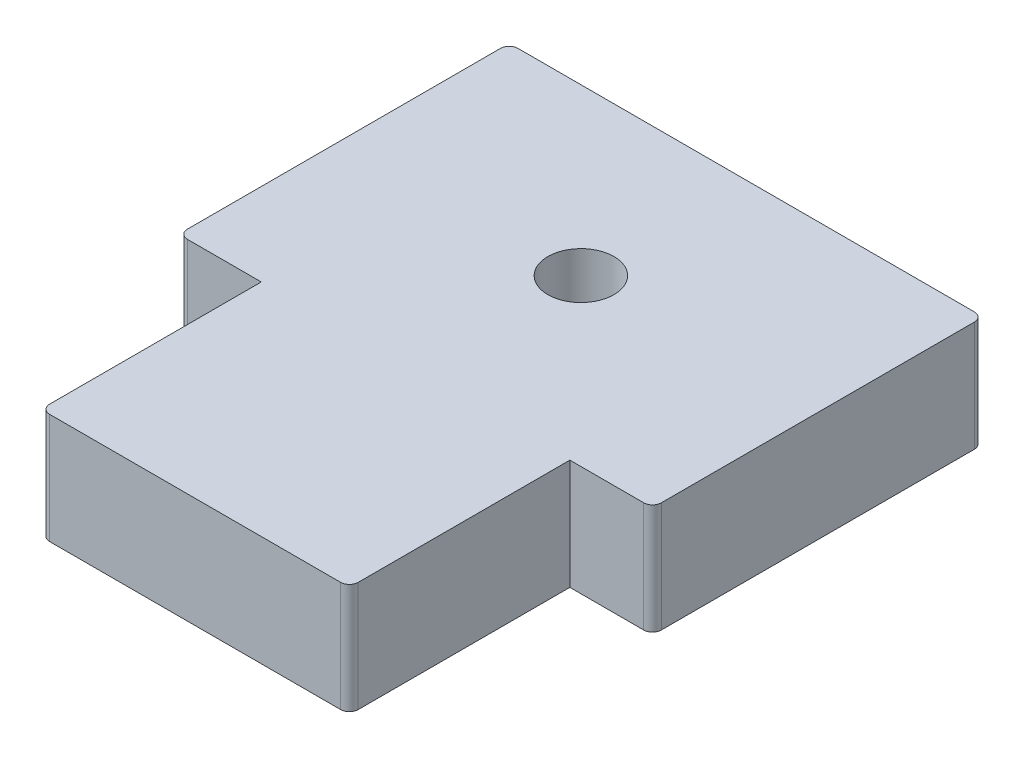
ISO-10303-21;
HEADER;
FILE_DESCRIPTION(('STEP AP214'),'2;1');
FILE_NAME('part.step','',(''),(''),'','','');
FILE_SCHEMA(('AUTOMOTIVE_DESIGN { 1 0 10303 214 1 1 1 1 }'));
ENDSEC;
DATA;
#1=APPLICATION_CONTEXT('core data for automotive mechanical design processes');
#2=APPLICATION_PROTOCOL_DEFINITION('international standard','automotive_design',2000,#1);
#3=PRODUCT_CONTEXT('',#1,'mechanical');
#4=PRODUCT('Part','Part','',(#3));
#5=PRODUCT_RELATED_PRODUCT_CATEGORY('part','',(#4));
#6=PRODUCT_DEFINITION_FORMATION('','',#4);
#7=PRODUCT_DEFINITION_CONTEXT('part definition',#1,'design');
#8=PRODUCT_DEFINITION('design','',#6,#7);
#9=PRODUCT_DEFINITION_SHAPE('','',#8);
#10=(LENGTH_UNIT() NAMED_UNIT(*) SI_UNIT(.MILLI.,.METRE.));
#11=(NAMED_UNIT(*) PLANE_ANGLE_UNIT() SI_UNIT($,.RADIAN.));
#12=(NAMED_UNIT(*) SI_UNIT($,.STERADIAN.) SOLID_ANGLE_UNIT());
#13=UNCERTAINTY_MEASURE_WITH_UNIT(LENGTH_MEASURE(1.E-05),#10,'distance_accuracy_value','');
#14=(GEOMETRIC_REPRESENTATION_CONTEXT(3) GLOBAL_UNCERTAINTY_ASSIGNED_CONTEXT((#13)) GLOBAL_UNIT_ASSIGNED_CONTEXT((#10,
#11,#12)) REPRESENTATION_CONTEXT('',''));
#15=CARTESIAN_POINT('',(0.,0.,0.));
#16=DIRECTION('',(0.,0.,1.));
#17=DIRECTION('',(1.,0.,0.));
#18=AXIS2_PLACEMENT_3D('',#15,#16,#17);
#19=CARTESIAN_POINT('',(140.,100.,150.));
#20=DIRECTION('',(0.,0.,-1.));
#21=DIRECTION('',(-1.,0.,0.));
#22=AXIS2_PLACEMENT_3D('',#19,#20,#21);
#23=PLANE('',#22);
#24=DIRECTION('',(1.,0.,0.));
#25=VECTOR('',#24,1.);
#26=CARTESIAN_POINT('',(140.,0.,150.));
#27=LINE('',#26,#25);
#28=CARTESIAN_POINT('',(140.,0.,150.));
#29=VERTEX_POINT('',#28);
#30=CARTESIAN_POINT('',(207.,0.,150.));
#31=VERTEX_POINT('',#30);
#32=EDGE_CURVE('E188',#29,#31,#27,.T.);
#33=ORIENTED_EDGE('',*,*,#32,.T.);
#34=DIRECTION('',(0.,-1.,0.));
#35=VECTOR('',#34,1.);
#36=CARTESIAN_POINT('',(207.,100.,150.));
#37=LINE('',#36,#35);
#38=CARTESIAN_POINT('',(207.,100.,150.));
#39=VERTEX_POINT('',#38);
#40=EDGE_CURVE('E277',#31,#39,#37,.F.);
#41=ORIENTED_EDGE('',*,*,#40,.T.);
#42=DIRECTION('',(1.,0.,0.));
#43=VECTOR('',#42,1.);
#44=CARTESIAN_POINT('',(140.,100.,150.));
#45=LINE('',#44,#43);
#46=CARTESIAN_POINT('',(140.,100.,150.));
#47=VERTEX_POINT('',#46);
#48=EDGE_CURVE('E216',#47,#39,#45,.T.);
#49=ORIENTED_EDGE('',*,*,#48,.F.);
#50=DIRECTION('',(0.,-1.,0.));
#51=VECTOR('',#50,1.);
#52=CARTESIAN_POINT('',(140.,100.,150.));
#53=LINE('',#52,#51);
#54=EDGE_CURVE('E174',#47,#29,#53,.T.);
#55=ORIENTED_EDGE('',*,*,#54,.T.);
#56=EDGE_LOOP('',(#33,#41,#49,#55));
#57=FACE_BOUND('',#56,.T.);
#58=ADVANCED_FACE('F45',(#57),#23,.F.);
#59=CARTESIAN_POINT('',(215.,100.,-150.));
#60=DIRECTION('',(-1.,0.,0.));
#61=DIRECTION('',(0.,0.,1.));
#62=AXIS2_PLACEMENT_3D('',#59,#60,#61);
#63=PLANE('',#62);
#64=DIRECTION('',(0.,0.,-1.));
#65=VECTOR('',#64,1.);
#66=CARTESIAN_POINT('',(215.,0.,-150.));
#67=LINE('',#66,#65);
#68=CARTESIAN_POINT('',(215.,0.,142.));
#69=VERTEX_POINT('',#68);
#70=CARTESIAN_POINT('',(215.,0.,-142.));
#71=VERTEX_POINT('',#70);
#72=EDGE_CURVE('E192',#69,#71,#67,.T.);
#73=ORIENTED_EDGE('',*,*,#72,.T.);
#74=DIRECTION('',(0.,-1.,0.));
#75=VECTOR('',#74,1.);
#76=CARTESIAN_POINT('',(215.,100.,-142.));
#77=LINE('',#76,#75);
#78=CARTESIAN_POINT('',(215.,100.,-142.));
#79=VERTEX_POINT('',#78);
#80=EDGE_CURVE('E274',#71,#79,#77,.F.);
#81=ORIENTED_EDGE('',*,*,#80,.T.);
#82=DIRECTION('',(0.,0.,-1.));
#83=VECTOR('',#82,1.);
#84=CARTESIAN_POINT('',(215.,100.,-150.));
#85=LINE('',#84,#83);
#86=CARTESIAN_POINT('',(215.,100.,142.));
#87=VERTEX_POINT('',#86);
#88=EDGE_CURVE('E307',#87,#79,#85,.T.);
#89=ORIENTED_EDGE('',*,*,#88,.F.);
#90=DIRECTION('',(0.,-1.,0.));
#91=VECTOR('',#90,1.);
#92=CARTESIAN_POINT('',(215.,100.,142.));
#93=LINE('',#92,#91);
#94=EDGE_CURVE('E270',#87,#69,#93,.T.);
#95=ORIENTED_EDGE('',*,*,#94,.T.);
#96=EDGE_LOOP('',(#73,#81,#89,#95));
#97=FACE_BOUND('',#96,.T.);
#98=ADVANCED_FACE('F315',(#97),#63,.F.);
#99=CARTESIAN_POINT('',(-215.,100.,-150.));
#100=DIRECTION('',(0.,0.,1.));
#101=DIRECTION('',(1.,0.,0.));
#102=AXIS2_PLACEMENT_3D('',#99,#100,#101);
#103=PLANE('',#102);
#104=DIRECTION('',(-1.,0.,0.));
#105=VECTOR('',#104,1.);
#106=CARTESIAN_POINT('',(-215.,0.,-150.));
#107=LINE('',#106,#105);
#108=CARTESIAN_POINT('',(207.,0.,-150.));
#109=VERTEX_POINT('',#108);
#110=CARTESIAN_POINT('',(-207.,0.,-150.));
#111=VERTEX_POINT('',#110);
#112=EDGE_CURVE('E197',#109,#111,#107,.T.);
#113=ORIENTED_EDGE('',*,*,#112,.T.);
#114=DIRECTION('',(0.,-1.,0.));
#115=VECTOR('',#114,1.);
#116=CARTESIAN_POINT('',(-207.,100.,-150.));
#117=LINE('',#116,#115);
#118=CARTESIAN_POINT('',(-207.,100.,-150.));
#119=VERTEX_POINT('',#118);
#120=EDGE_CURVE('E248',#111,#119,#117,.F.);
#121=ORIENTED_EDGE('',*,*,#120,.T.);
#122=DIRECTION('',(-1.,0.,0.));
#123=VECTOR('',#122,1.);
#124=CARTESIAN_POINT('',(-215.,100.,-150.));
#125=LINE('',#124,#123);
#126=CARTESIAN_POINT('',(207.,100.,-150.));
#127=VERTEX_POINT('',#126);
#128=EDGE_CURVE('E326',#127,#119,#125,.T.);
#129=ORIENTED_EDGE('',*,*,#128,.F.);
#130=DIRECTION('',(0.,-1.,0.));
#131=VECTOR('',#130,1.);
#132=CARTESIAN_POINT('',(207.,100.,-150.));
#133=LINE('',#132,#131);
#134=EDGE_CURVE('E244',#127,#109,#133,.T.);
#135=ORIENTED_EDGE('',*,*,#134,.T.);
#136=EDGE_LOOP('',(#113,#121,#129,#135));
#137=FACE_BOUND('',#136,.T.);
#138=ADVANCED_FACE('F324',(#137),#103,.F.);
#139=CARTESIAN_POINT('',(-215.,100.,-150.));
#140=DIRECTION('',(1.,0.,0.));
#141=DIRECTION('',(0.,0.,-1.));
#142=AXIS2_PLACEMENT_3D('',#139,#140,#141);
#143=PLANE('',#142);
#144=DIRECTION('',(0.,0.,1.));
#145=VECTOR('',#144,1.);
#146=CARTESIAN_POINT('',(-215.,100.,-150.));
#147=LINE('',#146,#145);
#148=CARTESIAN_POINT('',(-215.,100.,-142.));
#149=VERTEX_POINT('',#148);
#150=CARTESIAN_POINT('',(-215.,100.,142.));
#151=VERTEX_POINT('',#150);
#152=EDGE_CURVE('E162',#149,#151,#147,.T.);
#153=ORIENTED_EDGE('',*,*,#152,.F.);
#154=DIRECTION('',(0.,-1.,0.));
#155=VECTOR('',#154,1.);
#156=CARTESIAN_POINT('',(-215.,100.,-142.));
#157=LINE('',#156,#155);
#158=CARTESIAN_POINT('',(-215.,0.,-142.));
#159=VERTEX_POINT('',#158);
#160=EDGE_CURVE('E222',#149,#159,#157,.T.);
#161=ORIENTED_EDGE('',*,*,#160,.T.);
#162=DIRECTION('',(0.,0.,1.));
#163=VECTOR('',#162,1.);
#164=CARTESIAN_POINT('',(-215.,0.,-150.));
#165=LINE('',#164,#163);
#166=CARTESIAN_POINT('',(-215.,0.,142.));
#167=VERTEX_POINT('',#166);
#168=EDGE_CURVE('E201',#159,#167,#165,.T.);
#169=ORIENTED_EDGE('',*,*,#168,.T.);
#170=DIRECTION('',(0.,-1.,0.));
#171=VECTOR('',#170,1.);
#172=CARTESIAN_POINT('',(-215.,100.,142.));
#173=LINE('',#172,#171);
#174=EDGE_CURVE('E173',#167,#151,#173,.F.);
#175=ORIENTED_EDGE('',*,*,#174,.T.);
#176=EDGE_LOOP('',(#153,#161,#169,#175));
#177=FACE_BOUND('',#176,.T.);
#178=ADVANCED_FACE('F487',(#177),#143,.F.);
#179=CARTESIAN_POINT('',(-215.,100.,150.));
#180=DIRECTION('',(0.,0.,-1.));
#181=DIRECTION('',(-1.,0.,0.));
#182=AXIS2_PLACEMENT_3D('',#179,#180,#181);
#183=PLANE('',#182);
#184=DIRECTION('',(1.,0.,0.));
#185=VECTOR('',#184,1.);
#186=CARTESIAN_POINT('',(-215.,100.,150.));
#187=LINE('',#186,#185);
#188=CARTESIAN_POINT('',(-207.,100.,150.));
#189=VERTEX_POINT('',#188);
#190=CARTESIAN_POINT('',(-140.,100.,150.));
#191=VERTEX_POINT('',#190);
#192=EDGE_CURVE('E148',#189,#191,#187,.T.);
#193=ORIENTED_EDGE('',*,*,#192,.F.);
#194=DIRECTION('',(0.,-1.,0.));
#195=VECTOR('',#194,1.);
#196=CARTESIAN_POINT('',(-207.,100.,150.));
#197=LINE('',#196,#195);
#198=CARTESIAN_POINT('',(-207.,0.,150.));
#199=VERTEX_POINT('',#198);
#200=EDGE_CURVE('E267',#189,#199,#197,.T.);
#201=ORIENTED_EDGE('',*,*,#200,.T.);
#202=DIRECTION('',(1.,0.,0.));
#203=VECTOR('',#202,1.);
#204=CARTESIAN_POINT('',(-215.,0.,150.));
#205=LINE('',#204,#203);
#206=CARTESIAN_POINT('',(-140.,0.,150.));
#207=VERTEX_POINT('',#206);
#208=EDGE_CURVE('E168',#199,#207,#205,.T.);
#209=ORIENTED_EDGE('',*,*,#208,.T.);
#210=DIRECTION('',(0.,-1.,0.));
#211=VECTOR('',#210,1.);
#212=CARTESIAN_POINT('',(-140.,100.,150.));
#213=LINE('',#212,#211);
#214=EDGE_CURVE('E165',#191,#207,#213,.T.);
#215=ORIENTED_EDGE('',*,*,#214,.F.);
#216=EDGE_LOOP('',(#193,#201,#209,#215));
#217=FACE_BOUND('',#216,.T.);
#218=ADVANCED_FACE('F166',(#217),#183,.F.);
#219=CARTESIAN_POINT('',(-140.,100.,150.));
#220=DIRECTION('',(1.,0.,0.));
#221=DIRECTION('',(0.,0.,-1.));
#222=AXIS2_PLACEMENT_3D('',#219,#220,#221);
#223=PLANE('',#222);
#224=DIRECTION('',(0.,0.,1.));
#225=VECTOR('',#224,1.);
#226=CARTESIAN_POINT('',(-140.,0.,150.));
#227=LINE('',#226,#225);
#228=CARTESIAN_POINT('',(-140.,0.,342.));
#229=VERTEX_POINT('',#228);
#230=EDGE_CURVE('E207',#207,#229,#227,.T.);
#231=ORIENTED_EDGE('',*,*,#230,.T.);
#232=DIRECTION('',(0.,-1.,0.));
#233=VECTOR('',#232,1.);
#234=CARTESIAN_POINT('',(-140.,100.,342.));
#235=LINE('',#234,#233);
#236=CARTESIAN_POINT('',(-140.,100.,342.));
#237=VERTEX_POINT('',#236);
#238=EDGE_CURVE('E54',#229,#237,#235,.F.);
#239=ORIENTED_EDGE('',*,*,#238,.T.);
#240=DIRECTION('',(0.,0.,1.));
#241=VECTOR('',#240,1.);
#242=CARTESIAN_POINT('',(-140.,100.,150.));
#243=LINE('',#242,#241);
#244=EDGE_CURVE('E153',#191,#237,#243,.T.);
#245=ORIENTED_EDGE('',*,*,#244,.F.);
#246=ORIENTED_EDGE('',*,*,#214,.T.);
#247=EDGE_LOOP('',(#231,#239,#245,#246));
#248=FACE_BOUND('',#247,.T.);
#249=ADVANCED_FACE('F176',(#248),#223,.F.);
#250=CARTESIAN_POINT('',(-140.,100.,350.));
#251=DIRECTION('',(0.,0.,-1.));
#252=DIRECTION('',(-1.,0.,0.));
#253=AXIS2_PLACEMENT_3D('',#250,#251,#252);
#254=PLANE('',#253);
#255=DIRECTION('',(1.,0.,0.));
#256=VECTOR('',#255,1.);
#257=CARTESIAN_POINT('',(-140.,100.,350.));
#258=LINE('',#257,#256);
#259=CARTESIAN_POINT('',(-132.,100.,350.));
#260=VERTEX_POINT('',#259);
#261=CARTESIAN_POINT('',(132.,100.,350.));
#262=VERTEX_POINT('',#261);
#263=EDGE_CURVE('E179',#260,#262,#258,.T.);
#264=ORIENTED_EDGE('',*,*,#263,.F.);
#265=DIRECTION('',(0.,-1.,0.));
#266=VECTOR('',#265,1.);
#267=CARTESIAN_POINT('',(-132.,100.,350.));
#268=LINE('',#267,#266);
#269=CARTESIAN_POINT('',(-132.,0.,350.));
#270=VERTEX_POINT('',#269);
#271=EDGE_CURVE('E282',#260,#270,#268,.T.);
#272=ORIENTED_EDGE('',*,*,#271,.T.);
#273=DIRECTION('',(1.,0.,0.));
#274=VECTOR('',#273,1.);
#275=CARTESIAN_POINT('',(-140.,0.,350.));
#276=LINE('',#275,#274);
#277=CARTESIAN_POINT('',(132.,0.,350.));
#278=VERTEX_POINT('',#277);
#279=EDGE_CURVE('E210',#270,#278,#276,.T.);
#280=ORIENTED_EDGE('',*,*,#279,.T.);
#281=DIRECTION('',(0.,-1.,0.));
#282=VECTOR('',#281,1.);
#283=CARTESIAN_POINT('',(132.,100.,350.));
#284=LINE('',#283,#282);
#285=EDGE_CURVE('E69',#278,#262,#284,.F.);
#286=ORIENTED_EDGE('',*,*,#285,.T.);
#287=EDGE_LOOP('',(#264,#272,#280,#286));
#288=FACE_BOUND('',#287,.T.);
#289=ADVANCED_FACE('F288',(#288),#254,.F.);
#290=CARTESIAN_POINT('',(140.,100.,350.));
#291=DIRECTION('',(-1.,0.,0.));
#292=DIRECTION('',(0.,0.,1.));
#293=AXIS2_PLACEMENT_3D('',#290,#291,#292);
#294=PLANE('',#293);
#295=DIRECTION('',(0.,0.,-1.));
#296=VECTOR('',#295,1.);
#297=CARTESIAN_POINT('',(140.,100.,350.));
#298=LINE('',#297,#296);
#299=CARTESIAN_POINT('',(140.,100.,342.));
#300=VERTEX_POINT('',#299);
#301=EDGE_CURVE('E182',#300,#47,#298,.T.);
#302=ORIENTED_EDGE('',*,*,#301,.F.);
#303=DIRECTION('',(0.,-1.,0.));
#304=VECTOR('',#303,1.);
#305=CARTESIAN_POINT('',(140.,100.,342.));
#306=LINE('',#305,#304);
#307=CARTESIAN_POINT('',(140.,0.,342.));
#308=VERTEX_POINT('',#307);
#309=EDGE_CURVE('E11',#300,#308,#306,.T.);
#310=ORIENTED_EDGE('',*,*,#309,.T.);
#311=DIRECTION('',(0.,0.,-1.));
#312=VECTOR('',#311,1.);
#313=CARTESIAN_POINT('',(140.,0.,350.));
#314=LINE('',#313,#312);
#315=EDGE_CURVE('E213',#308,#29,#314,.T.);
#316=ORIENTED_EDGE('',*,*,#315,.T.);
#317=ORIENTED_EDGE('',*,*,#54,.F.);
#318=EDGE_LOOP('',(#302,#310,#316,#317));
#319=FACE_BOUND('',#318,.T.);
#320=ADVANCED_FACE('F298',(#319),#294,.F.);
#321=CARTESIAN_POINT('',(0.,100.,0.));
#322=DIRECTION('',(0.,-1.,0.));
#323=DIRECTION('',(0.,0.,-1.));
#324=AXIS2_PLACEMENT_3D('',#321,#322,#323);
#325=PLANE('',#324);
#326=CARTESIAN_POINT('',(0.,100.,0.));
#327=DIRECTION('',(0.,1.,0.));
#328=DIRECTION('',(0.,0.,1.));
#329=AXIS2_PLACEMENT_3D('',#326,#327,#328);
#330=CIRCLE('',#329,30.);
#331=CARTESIAN_POINT('',(0.,100.,30.));
#332=VERTEX_POINT('',#331);
#333=EDGE_CURVE('E334',#332,#332,#330,.T.);
#334=ORIENTED_EDGE('',*,*,#333,.F.);
#335=EDGE_LOOP('',(#334));
#336=FACE_BOUND('',#335,.T.);
#337=ORIENTED_EDGE('',*,*,#128,.T.);
#338=CARTESIAN_POINT('',(-207.,100.,-142.));
#339=DIRECTION('',(0.,-1.,0.));
#340=DIRECTION('',(0.,0.,-1.));
#341=AXIS2_PLACEMENT_3D('',#338,#339,#340);
#342=CIRCLE('',#341,8.);
#343=EDGE_CURVE('E264',#119,#149,#342,.F.);
#344=ORIENTED_EDGE('',*,*,#343,.T.);
#345=ORIENTED_EDGE('',*,*,#152,.T.);
#346=CARTESIAN_POINT('',(-207.,100.,142.));
#347=DIRECTION('',(0.,-1.,0.));
#348=DIRECTION('',(0.,0.,-1.));
#349=AXIS2_PLACEMENT_3D('',#346,#347,#348);
#350=CIRCLE('',#349,8.);
#351=EDGE_CURVE('E157',#151,#189,#350,.F.);
#352=ORIENTED_EDGE('',*,*,#351,.T.);
#353=ORIENTED_EDGE('',*,*,#192,.T.);
#354=ORIENTED_EDGE('',*,*,#244,.T.);
#355=CARTESIAN_POINT('',(-132.,100.,342.));
#356=DIRECTION('',(0.,-1.,0.));
#357=DIRECTION('',(0.,0.,-1.));
#358=AXIS2_PLACEMENT_3D('',#355,#356,#357);
#359=CIRCLE('',#358,8.);
#360=EDGE_CURVE('E253',#237,#260,#359,.F.);
#361=ORIENTED_EDGE('',*,*,#360,.T.);
#362=ORIENTED_EDGE('',*,*,#263,.T.);
#363=CARTESIAN_POINT('',(132.,100.,342.));
#364=DIRECTION('',(0.,-1.,0.));
#365=DIRECTION('',(0.,0.,-1.));
#366=AXIS2_PLACEMENT_3D('',#363,#364,#365);
#367=CIRCLE('',#366,8.);
#368=EDGE_CURVE('E61',#262,#300,#367,.F.);
#369=ORIENTED_EDGE('',*,*,#368,.T.);
#370=ORIENTED_EDGE('',*,*,#301,.T.);
#371=ORIENTED_EDGE('',*,*,#48,.T.);
#372=CARTESIAN_POINT('',(207.,100.,142.));
#373=DIRECTION('',(0.,-1.,0.));
#374=DIRECTION('',(0.,0.,-1.));
#375=AXIS2_PLACEMENT_3D('',#372,#373,#374);
#376=CIRCLE('',#375,8.);
#377=EDGE_CURVE('E256',#39,#87,#376,.F.);
#378=ORIENTED_EDGE('',*,*,#377,.T.);
#379=ORIENTED_EDGE('',*,*,#88,.T.);
#380=CARTESIAN_POINT('',(207.,100.,-142.));
#381=DIRECTION('',(0.,-1.,0.));
#382=DIRECTION('',(0.,0.,-1.));
#383=AXIS2_PLACEMENT_3D('',#380,#381,#382);
#384=CIRCLE('',#383,8.);
#385=EDGE_CURVE('E259',#79,#127,#384,.F.);
#386=ORIENTED_EDGE('',*,*,#385,.T.);
#387=EDGE_LOOP('',(#337,#344,#345,#352,#353,#354,#361,#362,#369,#370,#371,#378,#379,#386));
#388=FACE_BOUND('',#387,.T.);
#389=ADVANCED_FACE('F151',(#336,#388),#325,.F.);
#390=CARTESIAN_POINT('',(0.,0.,0.));
#391=DIRECTION('',(0.,-1.,0.));
#392=DIRECTION('',(0.,0.,-1.));
#393=AXIS2_PLACEMENT_3D('',#390,#391,#392);
#394=PLANE('',#393);
#395=ORIENTED_EDGE('',*,*,#168,.F.);
#396=CARTESIAN_POINT('',(-207.,0.,-142.));
#397=DIRECTION('',(0.,-1.,0.));
#398=DIRECTION('',(0.,0.,-1.));
#399=AXIS2_PLACEMENT_3D('',#396,#397,#398);
#400=CIRCLE('',#399,8.);
#401=EDGE_CURVE('E241',#159,#111,#400,.T.);
#402=ORIENTED_EDGE('',*,*,#401,.T.);
#403=ORIENTED_EDGE('',*,*,#112,.F.);
#404=CARTESIAN_POINT('',(207.,0.,-142.));
#405=DIRECTION('',(0.,-1.,0.));
#406=DIRECTION('',(0.,0.,-1.));
#407=AXIS2_PLACEMENT_3D('',#404,#405,#406);
#408=CIRCLE('',#407,8.);
#409=EDGE_CURVE('E235',#109,#71,#408,.T.);
#410=ORIENTED_EDGE('',*,*,#409,.T.);
#411=ORIENTED_EDGE('',*,*,#72,.F.);
#412=CARTESIAN_POINT('',(207.,0.,142.));
#413=DIRECTION('',(0.,-1.,0.));
#414=DIRECTION('',(0.,0.,-1.));
#415=AXIS2_PLACEMENT_3D('',#412,#413,#414);
#416=CIRCLE('',#415,8.);
#417=EDGE_CURVE('E232',#69,#31,#416,.T.);
#418=ORIENTED_EDGE('',*,*,#417,.T.);
#419=ORIENTED_EDGE('',*,*,#32,.F.);
#420=ORIENTED_EDGE('',*,*,#315,.F.);
#421=CARTESIAN_POINT('',(132.,0.,342.));
#422=DIRECTION('',(0.,-1.,0.));
#423=DIRECTION('',(0.,0.,-1.));
#424=AXIS2_PLACEMENT_3D('',#421,#422,#423);
#425=CIRCLE('',#424,8.);
#426=EDGE_CURVE('E226',#308,#278,#425,.T.);
#427=ORIENTED_EDGE('',*,*,#426,.T.);
#428=ORIENTED_EDGE('',*,*,#279,.F.);
#429=CARTESIAN_POINT('',(-132.,0.,342.));
#430=DIRECTION('',(0.,-1.,0.));
#431=DIRECTION('',(0.,0.,-1.));
#432=AXIS2_PLACEMENT_3D('',#429,#430,#431);
#433=CIRCLE('',#432,8.);
#434=EDGE_CURVE('E229',#270,#229,#433,.T.);
#435=ORIENTED_EDGE('',*,*,#434,.T.);
#436=ORIENTED_EDGE('',*,*,#230,.F.);
#437=ORIENTED_EDGE('',*,*,#208,.F.);
#438=CARTESIAN_POINT('',(-207.,0.,142.));
#439=DIRECTION('',(0.,-1.,0.));
#440=DIRECTION('',(0.,0.,-1.));
#441=AXIS2_PLACEMENT_3D('',#438,#439,#440);
#442=CIRCLE('',#441,8.);
#443=EDGE_CURVE('E238',#199,#167,#442,.T.);
#444=ORIENTED_EDGE('',*,*,#443,.T.);
#445=EDGE_LOOP('',(#395,#402,#403,#410,#411,#418,#419,#420,#427,#428,#435,#436,#437,#444));
#446=FACE_BOUND('',#445,.T.);
#447=ADVANCED_FACE('F292',(#446),#394,.T.);
#448=CARTESIAN_POINT('',(-207.,100.,-142.));
#449=DIRECTION('',(0.,-1.,0.));
#450=DIRECTION('',(0.,0.,-1.));
#451=AXIS2_PLACEMENT_3D('',#448,#449,#450);
#452=CYLINDRICAL_SURFACE('',#451,8.);
#453=ORIENTED_EDGE('',*,*,#343,.F.);
#454=ORIENTED_EDGE('',*,*,#120,.F.);
#455=ORIENTED_EDGE('',*,*,#401,.F.);
#456=ORIENTED_EDGE('',*,*,#160,.F.);
#457=EDGE_LOOP('',(#453,#454,#455,#456));
#458=FACE_BOUND('',#457,.T.);
#459=ADVANCED_FACE('F356',(#458),#452,.T.);
#460=CARTESIAN_POINT('',(-207.,100.,142.));
#461=DIRECTION('',(0.,-1.,0.));
#462=DIRECTION('',(0.,0.,-1.));
#463=AXIS2_PLACEMENT_3D('',#460,#461,#462);
#464=CYLINDRICAL_SURFACE('',#463,8.);
#465=ORIENTED_EDGE('',*,*,#351,.F.);
#466=ORIENTED_EDGE('',*,*,#174,.F.);
#467=ORIENTED_EDGE('',*,*,#443,.F.);
#468=ORIENTED_EDGE('',*,*,#200,.F.);
#469=EDGE_LOOP('',(#465,#466,#467,#468));
#470=FACE_BOUND('',#469,.T.);
#471=ADVANCED_FACE('F369',(#470),#464,.T.);
#472=CARTESIAN_POINT('',(207.,100.,-142.));
#473=DIRECTION('',(0.,-1.,0.));
#474=DIRECTION('',(0.,0.,-1.));
#475=AXIS2_PLACEMENT_3D('',#472,#473,#474);
#476=CYLINDRICAL_SURFACE('',#475,8.);
#477=ORIENTED_EDGE('',*,*,#385,.F.);
#478=ORIENTED_EDGE('',*,*,#80,.F.);
#479=ORIENTED_EDGE('',*,*,#409,.F.);
#480=ORIENTED_EDGE('',*,*,#134,.F.);
#481=EDGE_LOOP('',(#477,#478,#479,#480));
#482=FACE_BOUND('',#481,.T.);
#483=ADVANCED_FACE('F321',(#482),#476,.T.);
#484=CARTESIAN_POINT('',(207.,100.,142.));
#485=DIRECTION('',(0.,-1.,0.));
#486=DIRECTION('',(0.,0.,-1.));
#487=AXIS2_PLACEMENT_3D('',#484,#485,#486);
#488=CYLINDRICAL_SURFACE('',#487,8.);
#489=ORIENTED_EDGE('',*,*,#377,.F.);
#490=ORIENTED_EDGE('',*,*,#40,.F.);
#491=ORIENTED_EDGE('',*,*,#417,.F.);
#492=ORIENTED_EDGE('',*,*,#94,.F.);
#493=EDGE_LOOP('',(#489,#490,#491,#492));
#494=FACE_BOUND('',#493,.T.);
#495=ADVANCED_FACE('F312',(#494),#488,.T.);
#496=CARTESIAN_POINT('',(-132.,100.,342.));
#497=DIRECTION('',(0.,-1.,0.));
#498=DIRECTION('',(0.,0.,-1.));
#499=AXIS2_PLACEMENT_3D('',#496,#497,#498);
#500=CYLINDRICAL_SURFACE('',#499,8.);
#501=ORIENTED_EDGE('',*,*,#360,.F.);
#502=ORIENTED_EDGE('',*,*,#238,.F.);
#503=ORIENTED_EDGE('',*,*,#434,.F.);
#504=ORIENTED_EDGE('',*,*,#271,.F.);
#505=EDGE_LOOP('',(#501,#502,#503,#504));
#506=FACE_BOUND('',#505,.T.);
#507=ADVANCED_FACE('F377',(#506),#500,.T.);
#508=CARTESIAN_POINT('',(132.,100.,342.));
#509=DIRECTION('',(0.,-1.,0.));
#510=DIRECTION('',(0.,0.,-1.));
#511=AXIS2_PLACEMENT_3D('',#508,#509,#510);
#512=CYLINDRICAL_SURFACE('',#511,8.);
#513=ORIENTED_EDGE('',*,*,#368,.F.);
#514=ORIENTED_EDGE('',*,*,#285,.F.);
#515=ORIENTED_EDGE('',*,*,#426,.F.);
#516=ORIENTED_EDGE('',*,*,#309,.F.);
#517=EDGE_LOOP('',(#513,#514,#515,#516));
#518=FACE_BOUND('',#517,.T.);
#519=ADVANCED_FACE('F47',(#518),#512,.T.);
#520=CARTESIAN_POINT('',(0.,20.,0.));
#521=DIRECTION('',(0.,1.,0.));
#522=DIRECTION('',(0.,0.,1.));
#523=AXIS2_PLACEMENT_3D('',#520,#521,#522);
#524=CYLINDRICAL_SURFACE('',#523,30.);
#525=CARTESIAN_POINT('',(0.,20.,0.));
#526=DIRECTION('',(0.,1.,0.));
#527=DIRECTION('',(0.,0.,1.));
#528=AXIS2_PLACEMENT_3D('',#525,#526,#527);
#529=CIRCLE('',#528,30.);
#530=CARTESIAN_POINT('',(0.,20.,30.));
#531=VERTEX_POINT('',#530);
#532=EDGE_CURVE('E193',#531,#531,#529,.T.);
#533=ORIENTED_EDGE('',*,*,#532,.F.);
#534=EDGE_LOOP('',(#533));
#535=FACE_BOUND('',#534,.T.);
#536=ORIENTED_EDGE('',*,*,#333,.T.);
#537=EDGE_LOOP('',(#536));
#538=FACE_BOUND('',#537,.T.);
#539=ADVANCED_FACE('F344',(#535,#538),#524,.F.);
#540=CARTESIAN_POINT('',(0.,20.,0.));
#541=DIRECTION('',(0.,1.,0.));
#542=DIRECTION('',(0.,0.,1.));
#543=AXIS2_PLACEMENT_3D('',#540,#541,#542);
#544=PLANE('',#543);
#545=ORIENTED_EDGE('',*,*,#532,.T.);
#546=EDGE_LOOP('',(#545));
#547=FACE_BOUND('',#546,.T.);
#548=ADVANCED_FACE('F342',(#547),#544,.T.);
#549=CLOSED_SHELL('',(#58,#98,#138,#178,#218,#249,#289,#320,#389,#447,#459,#471,#483,#495,#507,
#519,#539,#548));
#550=MANIFOLD_SOLID_BREP('B2',#549);
#551=ADVANCED_BREP_SHAPE_REPRESENTATION('',(#18,#550),#14);
#552=SHAPE_DEFINITION_REPRESENTATION(#9,#551);
ENDSEC;
END-ISO-10303-21;
